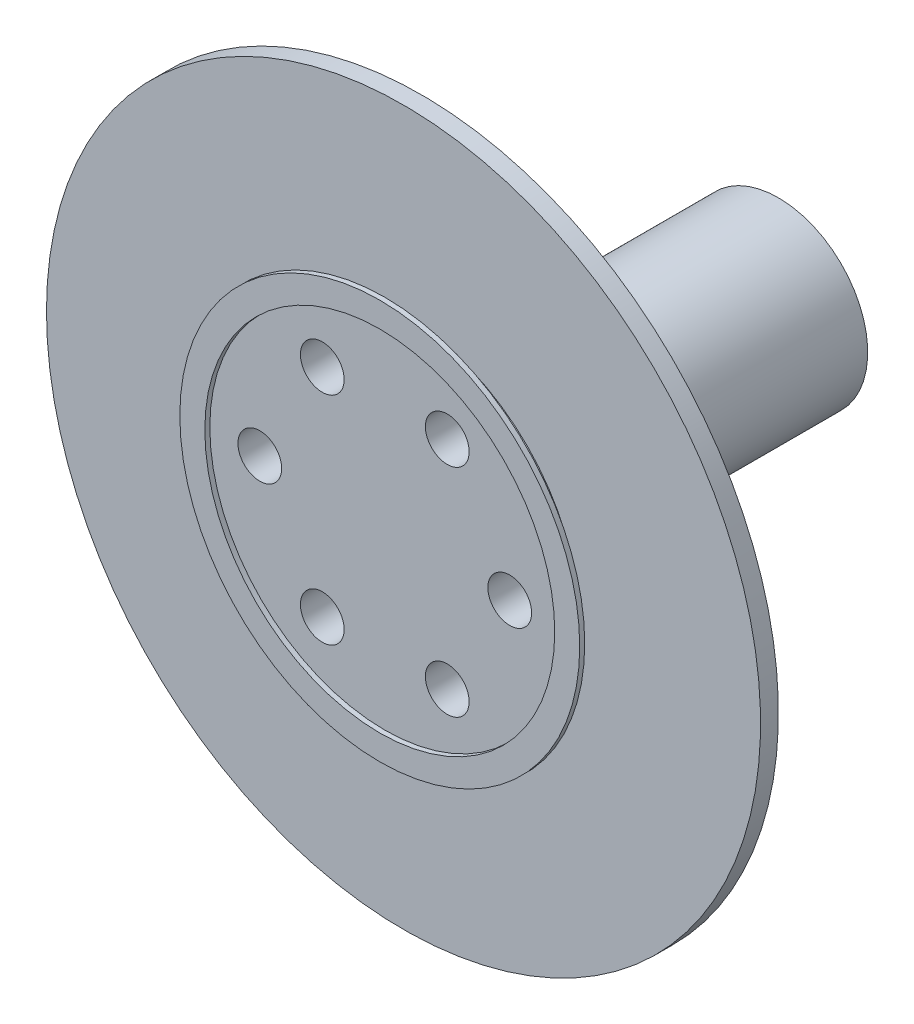
ISO-10303-21;
HEADER;
FILE_DESCRIPTION(('STEP AP214'),'2;1');
FILE_NAME('part.step','',(''),(''),'','','');
FILE_SCHEMA(('AUTOMOTIVE_DESIGN { 1 0 10303 214 1 1 1 1 }'));
ENDSEC;
DATA;
#1=APPLICATION_CONTEXT('core data for automotive mechanical design processes');
#2=APPLICATION_PROTOCOL_DEFINITION('international standard','automotive_design',2000,#1);
#3=PRODUCT_CONTEXT('',#1,'mechanical');
#4=PRODUCT('Part','Part','',(#3));
#5=PRODUCT_RELATED_PRODUCT_CATEGORY('part','',(#4));
#6=PRODUCT_DEFINITION_FORMATION('','',#4);
#7=PRODUCT_DEFINITION_CONTEXT('part definition',#1,'design');
#8=PRODUCT_DEFINITION('design','',#6,#7);
#9=PRODUCT_DEFINITION_SHAPE('','',#8);
#10=(LENGTH_UNIT() NAMED_UNIT(*) SI_UNIT(.MILLI.,.METRE.));
#11=(NAMED_UNIT(*) PLANE_ANGLE_UNIT() SI_UNIT($,.RADIAN.));
#12=(NAMED_UNIT(*) SI_UNIT($,.STERADIAN.) SOLID_ANGLE_UNIT());
#13=UNCERTAINTY_MEASURE_WITH_UNIT(LENGTH_MEASURE(1.E-05),#10,'distance_accuracy_value','');
#14=(GEOMETRIC_REPRESENTATION_CONTEXT(3) GLOBAL_UNCERTAINTY_ASSIGNED_CONTEXT((#13)) GLOBAL_UNIT_ASSIGNED_CONTEXT((#10,
#11,#12)) REPRESENTATION_CONTEXT('',''));
#15=CARTESIAN_POINT('',(0.,0.,0.));
#16=DIRECTION('',(0.,0.,1.));
#17=DIRECTION('',(1.,0.,0.));
#18=AXIS2_PLACEMENT_3D('',#15,#16,#17);
#19=CARTESIAN_POINT('',(0.,0.,-0.525));
#20=DIRECTION('',(0.,0.,1.));
#21=DIRECTION('',(1.,0.,0.));
#22=AXIS2_PLACEMENT_3D('',#19,#20,#21);
#23=CYLINDRICAL_SURFACE('',#22,4.9);
#24=CARTESIAN_POINT('',(0.,0.,-0.525));
#25=DIRECTION('',(0.,0.,-1.));
#26=DIRECTION('',(-1.,0.,0.));
#27=AXIS2_PLACEMENT_3D('',#24,#25,#26);
#28=CIRCLE('',#27,4.9);
#29=CARTESIAN_POINT('',(-4.9,0.,-0.525));
#30=VERTEX_POINT('',#29);
#31=EDGE_CURVE('E61',#30,#30,#28,.T.);
#32=ORIENTED_EDGE('',*,*,#31,.F.);
#33=EDGE_LOOP('',(#32));
#34=FACE_BOUND('',#33,.T.);
#35=CARTESIAN_POINT('',(0.,0.,0.));
#36=DIRECTION('',(0.,0.,-1.));
#37=DIRECTION('',(-1.,0.,0.));
#38=AXIS2_PLACEMENT_3D('',#35,#36,#37);
#39=CIRCLE('',#38,4.9);
#40=CARTESIAN_POINT('',(-4.9,0.,0.));
#41=VERTEX_POINT('',#40);
#42=EDGE_CURVE('E56',#41,#41,#39,.T.);
#43=ORIENTED_EDGE('',*,*,#42,.T.);
#44=EDGE_LOOP('',(#43));
#45=FACE_BOUND('',#44,.T.);
#46=ADVANCED_FACE('F53',(#34,#45),#23,.T.);
#47=CARTESIAN_POINT('',(0.,0.,0.));
#48=DIRECTION('',(0.,0.,-1.));
#49=DIRECTION('',(-1.,0.,0.));
#50=AXIS2_PLACEMENT_3D('',#47,#48,#49);
#51=PLANE('',#50);
#52=CARTESIAN_POINT('',(3.5,0.,0.));
#53=DIRECTION('',(0.,0.,1.));
#54=DIRECTION('',(1.,0.,0.));
#55=AXIS2_PLACEMENT_3D('',#52,#53,#54);
#56=CIRCLE('',#55,0.6125);
#57=CARTESIAN_POINT('',(4.1125,0.,0.));
#58=VERTEX_POINT('',#57);
#59=EDGE_CURVE('E127',#58,#58,#56,.T.);
#60=ORIENTED_EDGE('',*,*,#59,.F.);
#61=EDGE_LOOP('',(#60));
#62=FACE_BOUND('',#61,.T.);
#63=CARTESIAN_POINT('',(1.75,3.03108891324554,0.));
#64=DIRECTION('',(0.,0.,1.));
#65=DIRECTION('',(1.,0.,0.));
#66=AXIS2_PLACEMENT_3D('',#63,#64,#65);
#67=CIRCLE('',#66,0.612500000000002);
#68=CARTESIAN_POINT('',(2.3625,3.03108891324554,0.));
#69=VERTEX_POINT('',#68);
#70=EDGE_CURVE('E124',#69,#69,#67,.T.);
#71=ORIENTED_EDGE('',*,*,#70,.F.);
#72=EDGE_LOOP('',(#71));
#73=FACE_BOUND('',#72,.T.);
#74=CARTESIAN_POINT('',(-1.75,3.03108891324553,0.));
#75=DIRECTION('',(0.,0.,1.));
#76=DIRECTION('',(1.,0.,0.));
#77=AXIS2_PLACEMENT_3D('',#74,#75,#76);
#78=CIRCLE('',#77,0.612500000000001);
#79=CARTESIAN_POINT('',(-1.1375,3.03108891324553,0.));
#80=VERTEX_POINT('',#79);
#81=EDGE_CURVE('E133',#80,#80,#78,.T.);
#82=ORIENTED_EDGE('',*,*,#81,.F.);
#83=EDGE_LOOP('',(#82));
#84=FACE_BOUND('',#83,.T.);
#85=CARTESIAN_POINT('',(-3.5,0.,0.));
#86=DIRECTION('',(0.,0.,1.));
#87=DIRECTION('',(1.,0.,0.));
#88=AXIS2_PLACEMENT_3D('',#85,#86,#87);
#89=CIRCLE('',#88,0.6125);
#90=CARTESIAN_POINT('',(-2.8875,0.,0.));
#91=VERTEX_POINT('',#90);
#92=EDGE_CURVE('E139',#91,#91,#89,.T.);
#93=ORIENTED_EDGE('',*,*,#92,.F.);
#94=EDGE_LOOP('',(#93));
#95=FACE_BOUND('',#94,.T.);
#96=CARTESIAN_POINT('',(-1.75,-3.03108891324554,0.));
#97=DIRECTION('',(0.,0.,1.));
#98=DIRECTION('',(1.,0.,0.));
#99=AXIS2_PLACEMENT_3D('',#96,#97,#98);
#100=CIRCLE('',#99,0.6125);
#101=CARTESIAN_POINT('',(-1.1375,-3.03108891324554,0.));
#102=VERTEX_POINT('',#101);
#103=EDGE_CURVE('E136',#102,#102,#100,.T.);
#104=ORIENTED_EDGE('',*,*,#103,.F.);
#105=EDGE_LOOP('',(#104));
#106=FACE_BOUND('',#105,.T.);
#107=CARTESIAN_POINT('',(1.75,-3.03108891324554,0.));
#108=DIRECTION('',(0.,0.,1.));
#109=DIRECTION('',(1.,0.,0.));
#110=AXIS2_PLACEMENT_3D('',#107,#108,#109);
#111=CIRCLE('',#110,0.6125);
#112=CARTESIAN_POINT('',(2.3625,-3.03108891324554,0.));
#113=VERTEX_POINT('',#112);
#114=EDGE_CURVE('E130',#113,#113,#111,.T.);
#115=ORIENTED_EDGE('',*,*,#114,.F.);
#116=EDGE_LOOP('',(#115));
#117=FACE_BOUND('',#116,.T.);
#118=ORIENTED_EDGE('',*,*,#42,.F.);
#119=EDGE_LOOP('',(#118));
#120=FACE_BOUND('',#119,.T.);
#121=ADVANCED_FACE('F150',(#62,#73,#84,#95,#106,#117,#120),#51,.F.);
#122=CARTESIAN_POINT('',(1.75,-3.03108891324554,-2.25741161390705));
#123=DIRECTION('',(0.,0.,1.));
#124=DIRECTION('',(1.,0.,0.));
#125=AXIS2_PLACEMENT_3D('',#122,#123,#124);
#126=CYLINDRICAL_SURFACE('',#125,0.6125);
#127=ORIENTED_EDGE('',*,*,#114,.T.);
#128=EDGE_LOOP('',(#127));
#129=FACE_BOUND('',#128,.T.);
#130=CARTESIAN_POINT('',(1.75000000000001,-3.03108891324553,-1.025));
#131=DIRECTION('',(0.,0.,-1.));
#132=DIRECTION('',(-1.,0.,0.));
#133=AXIS2_PLACEMENT_3D('',#130,#131,#132);
#134=CIRCLE('',#133,0.6125);
#135=CARTESIAN_POINT('',(1.13750000000001,-3.03108891324553,-1.025));
#136=VERTEX_POINT('',#135);
#137=EDGE_CURVE('E114',#136,#136,#134,.T.);
#138=ORIENTED_EDGE('',*,*,#137,.T.);
#139=EDGE_LOOP('',(#138));
#140=FACE_BOUND('',#139,.T.);
#141=ADVANCED_FACE('F152',(#129,#140),#126,.F.);
#142=CARTESIAN_POINT('',(-1.75,-3.03108891324554,-2.25741161390705));
#143=DIRECTION('',(0.,0.,1.));
#144=DIRECTION('',(1.,0.,0.));
#145=AXIS2_PLACEMENT_3D('',#142,#143,#144);
#146=CYLINDRICAL_SURFACE('',#145,0.6125);
#147=ORIENTED_EDGE('',*,*,#103,.T.);
#148=EDGE_LOOP('',(#147));
#149=FACE_BOUND('',#148,.T.);
#150=CARTESIAN_POINT('',(-1.75,-3.03108891324554,-1.025));
#151=DIRECTION('',(0.,0.,-1.));
#152=DIRECTION('',(-1.,0.,0.));
#153=AXIS2_PLACEMENT_3D('',#150,#151,#152);
#154=CIRCLE('',#153,0.6125);
#155=CARTESIAN_POINT('',(-2.3625,-3.03108891324554,-1.025));
#156=VERTEX_POINT('',#155);
#157=EDGE_CURVE('E117',#156,#156,#154,.T.);
#158=ORIENTED_EDGE('',*,*,#157,.T.);
#159=EDGE_LOOP('',(#158));
#160=FACE_BOUND('',#159,.T.);
#161=ADVANCED_FACE('F158',(#149,#160),#146,.F.);
#162=CARTESIAN_POINT('',(-3.5,0.,-2.25741161390705));
#163=DIRECTION('',(0.,0.,1.));
#164=DIRECTION('',(1.,0.,0.));
#165=AXIS2_PLACEMENT_3D('',#162,#163,#164);
#166=CYLINDRICAL_SURFACE('',#165,0.6125);
#167=ORIENTED_EDGE('',*,*,#92,.T.);
#168=EDGE_LOOP('',(#167));
#169=FACE_BOUND('',#168,.T.);
#170=CARTESIAN_POINT('',(-3.5,0.,-1.025));
#171=DIRECTION('',(0.,0.,-1.));
#172=DIRECTION('',(-1.,0.,0.));
#173=AXIS2_PLACEMENT_3D('',#170,#171,#172);
#174=CIRCLE('',#173,0.6125);
#175=CARTESIAN_POINT('',(-4.1125,0.,-1.025));
#176=VERTEX_POINT('',#175);
#177=EDGE_CURVE('E101',#176,#176,#174,.T.);
#178=ORIENTED_EDGE('',*,*,#177,.T.);
#179=EDGE_LOOP('',(#178));
#180=FACE_BOUND('',#179,.T.);
#181=ADVANCED_FACE('F169',(#169,#180),#166,.F.);
#182=CARTESIAN_POINT('',(-1.75,3.03108891324553,-2.25741161390705));
#183=DIRECTION('',(0.,0.,1.));
#184=DIRECTION('',(1.,0.,0.));
#185=AXIS2_PLACEMENT_3D('',#182,#183,#184);
#186=CYLINDRICAL_SURFACE('',#185,0.612500000000001);
#187=ORIENTED_EDGE('',*,*,#81,.T.);
#188=EDGE_LOOP('',(#187));
#189=FACE_BOUND('',#188,.T.);
#190=CARTESIAN_POINT('',(-1.75000000000003,3.03108891324552,-1.025));
#191=DIRECTION('',(0.,0.,-1.));
#192=DIRECTION('',(-1.,0.,0.));
#193=AXIS2_PLACEMENT_3D('',#190,#191,#192);
#194=CIRCLE('',#193,0.6125);
#195=CARTESIAN_POINT('',(-2.36250000000003,3.03108891324552,-1.025));
#196=VERTEX_POINT('',#195);
#197=EDGE_CURVE('E105',#196,#196,#194,.T.);
#198=ORIENTED_EDGE('',*,*,#197,.T.);
#199=EDGE_LOOP('',(#198));
#200=FACE_BOUND('',#199,.T.);
#201=ADVANCED_FACE('F165',(#189,#200),#186,.F.);
#202=CARTESIAN_POINT('',(1.75,3.03108891324554,-2.25741161390705));
#203=DIRECTION('',(0.,0.,1.));
#204=DIRECTION('',(1.,0.,0.));
#205=AXIS2_PLACEMENT_3D('',#202,#203,#204);
#206=CYLINDRICAL_SURFACE('',#205,0.612500000000002);
#207=ORIENTED_EDGE('',*,*,#70,.T.);
#208=EDGE_LOOP('',(#207));
#209=FACE_BOUND('',#208,.T.);
#210=CARTESIAN_POINT('',(1.74999999999998,3.03108891324555,-1.025));
#211=DIRECTION('',(0.,0.,-1.));
#212=DIRECTION('',(-1.,0.,0.));
#213=AXIS2_PLACEMENT_3D('',#210,#211,#212);
#214=CIRCLE('',#213,0.6125);
#215=CARTESIAN_POINT('',(1.13749999999998,3.03108891324555,-1.025));
#216=VERTEX_POINT('',#215);
#217=EDGE_CURVE('E108',#216,#216,#214,.T.);
#218=ORIENTED_EDGE('',*,*,#217,.T.);
#219=EDGE_LOOP('',(#218));
#220=FACE_BOUND('',#219,.T.);
#221=ADVANCED_FACE('F168',(#209,#220),#206,.F.);
#222=CARTESIAN_POINT('',(3.5,0.,-2.25741161390705));
#223=DIRECTION('',(0.,0.,1.));
#224=DIRECTION('',(1.,0.,0.));
#225=AXIS2_PLACEMENT_3D('',#222,#223,#224);
#226=CYLINDRICAL_SURFACE('',#225,0.6125);
#227=ORIENTED_EDGE('',*,*,#59,.T.);
#228=EDGE_LOOP('',(#227));
#229=FACE_BOUND('',#228,.T.);
#230=CARTESIAN_POINT('',(3.5,0.,-1.025));
#231=DIRECTION('',(0.,0.,-1.));
#232=DIRECTION('',(-1.,0.,0.));
#233=AXIS2_PLACEMENT_3D('',#230,#231,#232);
#234=CIRCLE('',#233,0.6125);
#235=CARTESIAN_POINT('',(2.8875,0.,-1.025));
#236=VERTEX_POINT('',#235);
#237=EDGE_CURVE('E111',#236,#236,#234,.T.);
#238=ORIENTED_EDGE('',*,*,#237,.T.);
#239=EDGE_LOOP('',(#238));
#240=FACE_BOUND('',#239,.T.);
#241=ADVANCED_FACE('F179',(#229,#240),#226,.F.);
#242=CARTESIAN_POINT('',(0.,0.,-1.025));
#243=DIRECTION('',(0.,0.,-1.));
#244=DIRECTION('',(-1.,0.,0.));
#245=AXIS2_PLACEMENT_3D('',#242,#243,#244);
#246=PLANE('',#245);
#247=CARTESIAN_POINT('',(0.,0.,-1.025));
#248=DIRECTION('',(0.,0.,-1.));
#249=DIRECTION('',(-1.,0.,0.));
#250=AXIS2_PLACEMENT_3D('',#247,#248,#249);
#251=CIRCLE('',#250,2.5);
#252=CARTESIAN_POINT('',(-2.5,0.,-1.025));
#253=VERTEX_POINT('',#252);
#254=EDGE_CURVE('E13',#253,#253,#251,.T.);
#255=ORIENTED_EDGE('',*,*,#254,.F.);
#256=EDGE_LOOP('',(#255));
#257=FACE_BOUND('',#256,.T.);
#258=ORIENTED_EDGE('',*,*,#197,.F.);
#259=EDGE_LOOP('',(#258));
#260=FACE_BOUND('',#259,.T.);
#261=ORIENTED_EDGE('',*,*,#237,.F.);
#262=EDGE_LOOP('',(#261));
#263=FACE_BOUND('',#262,.T.);
#264=ORIENTED_EDGE('',*,*,#157,.F.);
#265=EDGE_LOOP('',(#264));
#266=FACE_BOUND('',#265,.T.);
#267=CARTESIAN_POINT('',(0.,0.,-1.025));
#268=DIRECTION('',(0.,0.,-1.));
#269=DIRECTION('',(-1.,0.,0.));
#270=AXIS2_PLACEMENT_3D('',#267,#268,#269);
#271=CIRCLE('',#270,10.);
#272=CARTESIAN_POINT('',(-10.,0.,-1.025));
#273=VERTEX_POINT('',#272);
#274=EDGE_CURVE('E121',#273,#273,#271,.T.);
#275=ORIENTED_EDGE('',*,*,#274,.T.);
#276=EDGE_LOOP('',(#275));
#277=FACE_BOUND('',#276,.T.);
#278=ORIENTED_EDGE('',*,*,#137,.F.);
#279=EDGE_LOOP('',(#278));
#280=FACE_BOUND('',#279,.T.);
#281=ORIENTED_EDGE('',*,*,#217,.F.);
#282=EDGE_LOOP('',(#281));
#283=FACE_BOUND('',#282,.T.);
#284=ORIENTED_EDGE('',*,*,#177,.F.);
#285=EDGE_LOOP('',(#284));
#286=FACE_BOUND('',#285,.T.);
#287=ADVANCED_FACE('F183',(#257,#260,#263,#266,#277,#280,#283,#286),#246,.T.);
#288=CARTESIAN_POINT('',(0.,0.,-0.525));
#289=DIRECTION('',(0.,0.,-1.));
#290=DIRECTION('',(-1.,0.,0.));
#291=AXIS2_PLACEMENT_3D('',#288,#289,#290);
#292=PLANE('',#291);
#293=ORIENTED_EDGE('',*,*,#31,.T.);
#294=EDGE_LOOP('',(#293));
#295=FACE_BOUND('',#294,.T.);
#296=CARTESIAN_POINT('',(0.,0.,-0.525));
#297=DIRECTION('',(0.,0.,-1.));
#298=DIRECTION('',(-1.,0.,0.));
#299=AXIS2_PLACEMENT_3D('',#296,#297,#298);
#300=CIRCLE('',#299,10.);
#301=CARTESIAN_POINT('',(-10.,0.,-0.525));
#302=VERTEX_POINT('',#301);
#303=EDGE_CURVE('E120',#302,#302,#300,.T.);
#304=ORIENTED_EDGE('',*,*,#303,.F.);
#305=EDGE_LOOP('',(#304));
#306=FACE_BOUND('',#305,.T.);
#307=ADVANCED_FACE('F189',(#295,#306),#292,.F.);
#308=CARTESIAN_POINT('',(0.,0.,-1.025));
#309=DIRECTION('',(0.,0.,1.));
#310=DIRECTION('',(1.,0.,0.));
#311=AXIS2_PLACEMENT_3D('',#308,#309,#310);
#312=CYLINDRICAL_SURFACE('',#311,10.);
#313=ORIENTED_EDGE('',*,*,#274,.F.);
#314=EDGE_LOOP('',(#313));
#315=FACE_BOUND('',#314,.T.);
#316=ORIENTED_EDGE('',*,*,#303,.T.);
#317=EDGE_LOOP('',(#316));
#318=FACE_BOUND('',#317,.T.);
#319=ADVANCED_FACE('F185',(#315,#318),#312,.T.);
#320=CARTESIAN_POINT('',(0.,0.,-11.025));
#321=DIRECTION('',(0.,0.,-1.));
#322=DIRECTION('',(-1.,0.,0.));
#323=AXIS2_PLACEMENT_3D('',#320,#321,#322);
#324=PLANE('',#323);
#325=CARTESIAN_POINT('',(0.,0.,-11.025));
#326=DIRECTION('',(0.,0.,-1.));
#327=DIRECTION('',(-1.,0.,0.));
#328=AXIS2_PLACEMENT_3D('',#325,#326,#327);
#329=CIRCLE('',#328,2.5);
#330=CARTESIAN_POINT('',(-2.5,0.,-11.025));
#331=VERTEX_POINT('',#330);
#332=EDGE_CURVE('E91',#331,#331,#329,.T.);
#333=ORIENTED_EDGE('',*,*,#332,.T.);
#334=EDGE_LOOP('',(#333));
#335=FACE_BOUND('',#334,.T.);
#336=DIRECTION('',(1.,0.,0.));
#337=VECTOR('',#336,1.);
#338=CARTESIAN_POINT('',(1.24899959967968,1.,-11.025));
#339=LINE('',#338,#337);
#340=CARTESIAN_POINT('',(-1.24899959967968,1.,-11.025));
#341=VERTEX_POINT('',#340);
#342=CARTESIAN_POINT('',(1.24899959967968,1.,-11.025));
#343=VERTEX_POINT('',#342);
#344=EDGE_CURVE('E96',#341,#343,#339,.T.);
#345=ORIENTED_EDGE('',*,*,#344,.F.);
#346=CARTESIAN_POINT('',(0.,0.,-11.025));
#347=DIRECTION('',(0.,0.,-1.));
#348=DIRECTION('',(-1.,0.,0.));
#349=AXIS2_PLACEMENT_3D('',#346,#347,#348);
#350=CIRCLE('',#349,1.6);
#351=EDGE_CURVE('E84',#343,#341,#350,.T.);
#352=ORIENTED_EDGE('',*,*,#351,.F.);
#353=EDGE_LOOP('',(#345,#352));
#354=FACE_BOUND('',#353,.T.);
#355=ADVANCED_FACE('F188',(#335,#354),#324,.T.);
#356=CARTESIAN_POINT('',(0.,0.,-11.025));
#357=DIRECTION('',(0.,0.,1.));
#358=DIRECTION('',(1.,0.,0.));
#359=AXIS2_PLACEMENT_3D('',#356,#357,#358);
#360=CYLINDRICAL_SURFACE('',#359,2.5);
#361=ORIENTED_EDGE('',*,*,#332,.F.);
#362=EDGE_LOOP('',(#361));
#363=FACE_BOUND('',#362,.T.);
#364=ORIENTED_EDGE('',*,*,#254,.T.);
#365=EDGE_LOOP('',(#364));
#366=FACE_BOUND('',#365,.T.);
#367=ADVANCED_FACE('F196',(#363,#366),#360,.T.);
#368=CARTESIAN_POINT('',(0.,0.,-11.025));
#369=DIRECTION('',(0.,0.,1.));
#370=DIRECTION('',(1.,0.,0.));
#371=AXIS2_PLACEMENT_3D('',#368,#369,#370);
#372=CYLINDRICAL_SURFACE('',#371,1.6);
#373=CARTESIAN_POINT('',(0.,0.,-1.025));
#374=DIRECTION('',(0.,0.,-1.));
#375=DIRECTION('',(-1.,0.,0.));
#376=AXIS2_PLACEMENT_3D('',#373,#374,#375);
#377=CIRCLE('',#376,1.6);
#378=CARTESIAN_POINT('',(1.24899959967968,1.,-1.025));
#379=VERTEX_POINT('',#378);
#380=CARTESIAN_POINT('',(-1.24899959967968,1.,-1.025));
#381=VERTEX_POINT('',#380);
#382=EDGE_CURVE('E85',#379,#381,#377,.T.);
#383=ORIENTED_EDGE('',*,*,#382,.F.);
#384=DIRECTION('',(0.,0.,1.));
#385=VECTOR('',#384,1.);
#386=CARTESIAN_POINT('',(1.24899959967968,1.,-11.025));
#387=LINE('',#386,#385);
#388=EDGE_CURVE('E69',#343,#379,#387,.T.);
#389=ORIENTED_EDGE('',*,*,#388,.F.);
#390=ORIENTED_EDGE('',*,*,#351,.T.);
#391=DIRECTION('',(0.,0.,1.));
#392=VECTOR('',#391,1.);
#393=CARTESIAN_POINT('',(-1.24899959967968,1.,-11.025));
#394=LINE('',#393,#392);
#395=EDGE_CURVE('E74',#341,#381,#394,.T.);
#396=ORIENTED_EDGE('',*,*,#395,.T.);
#397=EDGE_LOOP('',(#383,#389,#390,#396));
#398=FACE_BOUND('',#397,.T.);
#399=ADVANCED_FACE('F88',(#398),#372,.F.);
#400=CARTESIAN_POINT('',(1.24899959967968,1.,-11.025));
#401=DIRECTION('',(0.,-1.,0.));
#402=DIRECTION('',(0.,0.,-1.));
#403=AXIS2_PLACEMENT_3D('',#400,#401,#402);
#404=PLANE('',#403);
#405=DIRECTION('',(1.,0.,0.));
#406=VECTOR('',#405,1.);
#407=CARTESIAN_POINT('',(1.24899959967968,1.,-1.025));
#408=LINE('',#407,#406);
#409=EDGE_CURVE('E80',#381,#379,#408,.T.);
#410=ORIENTED_EDGE('',*,*,#409,.F.);
#411=ORIENTED_EDGE('',*,*,#395,.F.);
#412=ORIENTED_EDGE('',*,*,#344,.T.);
#413=ORIENTED_EDGE('',*,*,#388,.T.);
#414=EDGE_LOOP('',(#410,#411,#412,#413));
#415=FACE_BOUND('',#414,.T.);
#416=ADVANCED_FACE('F81',(#415),#404,.T.);
#417=ORIENTED_EDGE('',*,*,#409,.T.);
#418=ORIENTED_EDGE('',*,*,#382,.T.);
#419=EDGE_LOOP('',(#417,#418));
#420=FACE_BOUND('',#419,.T.);
#421=ADVANCED_FACE('F93',(#420),#246,.T.);
#422=CLOSED_SHELL('',(#46,#121,#141,#161,#181,#201,#221,#241,#287,#307,#319,#355,#367,#399,#416,#421));
#423=MANIFOLD_SOLID_BREP('B2',#422);
#424=CARTESIAN_POINT('',(0.,0.,0.14));
#425=DIRECTION('',(0.,0.,1.));
#426=DIRECTION('',(1.,0.,0.));
#427=AXIS2_PLACEMENT_3D('',#424,#425,#426);
#428=PLANE('',#427);
#429=CARTESIAN_POINT('',(0.,0.,0.14));
#430=DIRECTION('',(0.,0.,1.));
#431=DIRECTION('',(1.,0.,0.));
#432=AXIS2_PLACEMENT_3D('',#429,#430,#431);
#433=CIRCLE('',#432,5.6);
#434=CARTESIAN_POINT('',(5.6,0.,0.14));
#435=VERTEX_POINT('',#434);
#436=EDGE_CURVE('E52',#435,#435,#433,.T.);
#437=ORIENTED_EDGE('',*,*,#436,.T.);
#438=EDGE_LOOP('',(#437));
#439=FACE_BOUND('',#438,.T.);
#440=CARTESIAN_POINT('',(0.,0.,0.14));
#441=DIRECTION('',(0.,0.,1.));
#442=DIRECTION('',(1.,0.,0.));
#443=AXIS2_PLACEMENT_3D('',#440,#441,#442);
#444=CIRCLE('',#443,4.9);
#445=CARTESIAN_POINT('',(4.9,0.,0.14));
#446=VERTEX_POINT('',#445);
#447=EDGE_CURVE('E401',#446,#446,#444,.T.);
#448=ORIENTED_EDGE('',*,*,#447,.F.);
#449=EDGE_LOOP('',(#448));
#450=FACE_BOUND('',#449,.T.);
#451=ADVANCED_FACE('F390',(#439,#450),#428,.T.);
#452=CARTESIAN_POINT('',(0.,0.,0.));
#453=DIRECTION('',(0.,0.,1.));
#454=DIRECTION('',(1.,0.,0.));
#455=AXIS2_PLACEMENT_3D('',#452,#453,#454);
#456=PLANE('',#455);
#457=CARTESIAN_POINT('',(0.,0.,0.));
#458=DIRECTION('',(0.,0.,1.));
#459=DIRECTION('',(1.,0.,0.));
#460=AXIS2_PLACEMENT_3D('',#457,#458,#459);
#461=CIRCLE('',#460,5.6);
#462=CARTESIAN_POINT('',(5.6,0.,0.));
#463=VERTEX_POINT('',#462);
#464=EDGE_CURVE('E394',#463,#463,#461,.T.);
#465=ORIENTED_EDGE('',*,*,#464,.F.);
#466=EDGE_LOOP('',(#465));
#467=FACE_BOUND('',#466,.T.);
#468=CARTESIAN_POINT('',(0.,0.,0.));
#469=DIRECTION('',(0.,0.,1.));
#470=DIRECTION('',(1.,0.,0.));
#471=AXIS2_PLACEMENT_3D('',#468,#469,#470);
#472=CIRCLE('',#471,4.9);
#473=CARTESIAN_POINT('',(4.9,0.,0.));
#474=VERTEX_POINT('',#473);
#475=EDGE_CURVE('E403',#474,#474,#472,.T.);
#476=ORIENTED_EDGE('',*,*,#475,.T.);
#477=EDGE_LOOP('',(#476));
#478=FACE_BOUND('',#477,.T.);
#479=ADVANCED_FACE('F413',(#467,#478),#456,.F.);
#480=CARTESIAN_POINT('',(0.,0.,0.14));
#481=DIRECTION('',(0.,0.,-1.));
#482=DIRECTION('',(-1.,0.,0.));
#483=AXIS2_PLACEMENT_3D('',#480,#481,#482);
#484=CYLINDRICAL_SURFACE('',#483,5.6);
#485=ORIENTED_EDGE('',*,*,#436,.F.);
#486=EDGE_LOOP('',(#485));
#487=FACE_BOUND('',#486,.T.);
#488=ORIENTED_EDGE('',*,*,#464,.T.);
#489=EDGE_LOOP('',(#488));
#490=FACE_BOUND('',#489,.T.);
#491=ADVANCED_FACE('F392',(#487,#490),#484,.T.);
#492=CARTESIAN_POINT('',(0.,0.,0.14));
#493=DIRECTION('',(0.,0.,-1.));
#494=DIRECTION('',(-1.,0.,0.));
#495=AXIS2_PLACEMENT_3D('',#492,#493,#494);
#496=CYLINDRICAL_SURFACE('',#495,4.9);
#497=ORIENTED_EDGE('',*,*,#447,.T.);
#498=EDGE_LOOP('',(#497));
#499=FACE_BOUND('',#498,.T.);
#500=ORIENTED_EDGE('',*,*,#475,.F.);
#501=EDGE_LOOP('',(#500));
#502=FACE_BOUND('',#501,.T.);
#503=ADVANCED_FACE('F409',(#499,#502),#496,.F.);
#504=CLOSED_SHELL('',(#451,#479,#491,#503));
#505=MANIFOLD_SOLID_BREP('B7',#504);
#506=ADVANCED_BREP_SHAPE_REPRESENTATION('',(#18,#423,#505),#14);
#507=SHAPE_DEFINITION_REPRESENTATION(#9,#506);
ENDSEC;
END-ISO-10303-21;
